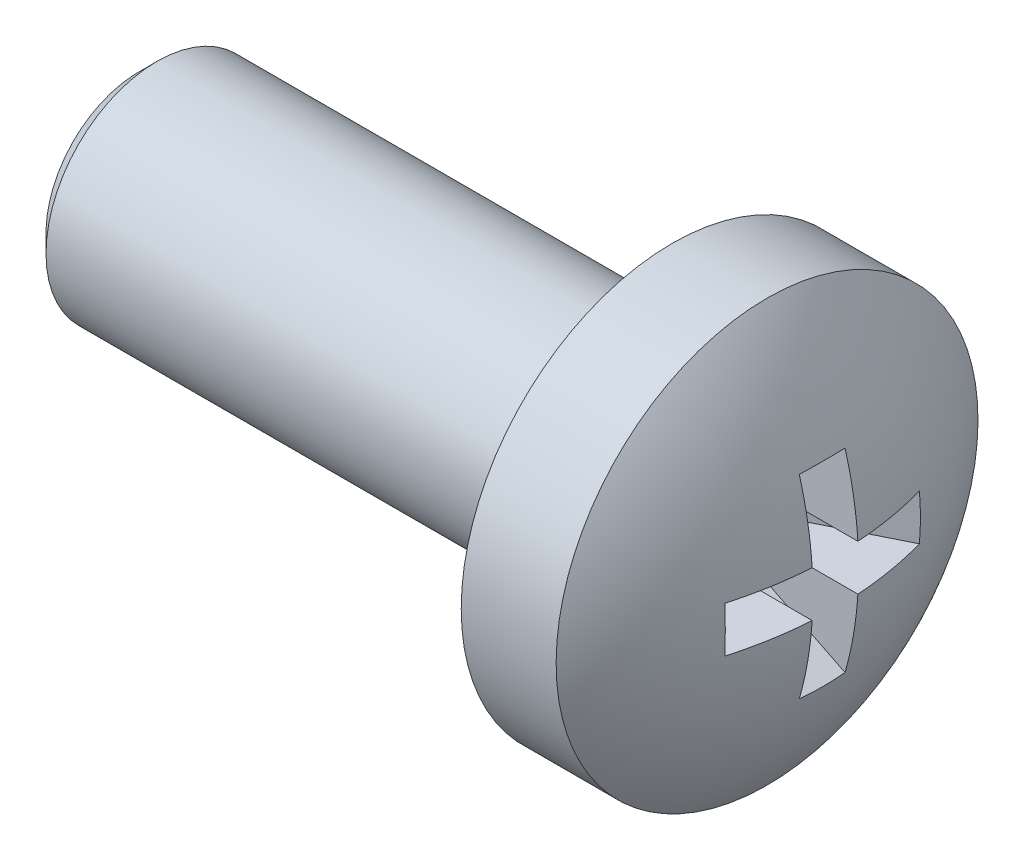
ISO-10303-21;
HEADER;
FILE_DESCRIPTION(('STEP AP214'),'2;1');
FILE_NAME('part.step','',(''),(''),'','','');
FILE_SCHEMA(('AUTOMOTIVE_DESIGN { 1 0 10303 214 1 1 1 1 }'));
ENDSEC;
DATA;
#1=APPLICATION_CONTEXT('core data for automotive mechanical design processes');
#2=APPLICATION_PROTOCOL_DEFINITION('international standard','automotive_design',2000,#1);
#3=PRODUCT_CONTEXT('',#1,'mechanical');
#4=PRODUCT('Part','Part','',(#3));
#5=PRODUCT_RELATED_PRODUCT_CATEGORY('part','',(#4));
#6=PRODUCT_DEFINITION_FORMATION('','',#4);
#7=PRODUCT_DEFINITION_CONTEXT('part definition',#1,'design');
#8=PRODUCT_DEFINITION('design','',#6,#7);
#9=PRODUCT_DEFINITION_SHAPE('','',#8);
#10=(LENGTH_UNIT() NAMED_UNIT(*) SI_UNIT(.MILLI.,.METRE.));
#11=(NAMED_UNIT(*) PLANE_ANGLE_UNIT() SI_UNIT($,.RADIAN.));
#12=(NAMED_UNIT(*) SI_UNIT($,.STERADIAN.) SOLID_ANGLE_UNIT());
#13=UNCERTAINTY_MEASURE_WITH_UNIT(LENGTH_MEASURE(1.E-05),#10,'distance_accuracy_value','');
#14=(GEOMETRIC_REPRESENTATION_CONTEXT(3) GLOBAL_UNCERTAINTY_ASSIGNED_CONTEXT((#13)) GLOBAL_UNIT_ASSIGNED_CONTEXT((#10,
#11,#12)) REPRESENTATION_CONTEXT('',''));
#15=CARTESIAN_POINT('',(0.,0.,0.));
#16=DIRECTION('',(0.,0.,1.));
#17=DIRECTION('',(1.,0.,0.));
#18=AXIS2_PLACEMENT_3D('',#15,#16,#17);
#19=CARTESIAN_POINT('',(-8.,0.,0.));
#20=DIRECTION('',(1.,0.,0.));
#21=DIRECTION('',(0.,-1.,0.));
#22=AXIS2_PLACEMENT_3D('',#19,#20,#21);
#23=SPHERICAL_SURFACE('',#22,8.);
#24=CARTESIAN_POINT('',(-7.34565681691376,0.,-1.31240938798552));
#25=DIRECTION('',(0.446197813109809,0.,-0.894934361602025));
#26=DIRECTION('',(-0.894934361602025,0.,-0.446197813109809));
#27=AXIS2_PLACEMENT_3D('',#24,#25,#26);
#28=CIRCLE('',#27,7.86444000530718);
#29=CARTESIAN_POINT('',(-0.322606080628619,0.515,2.18915454155237));
#30=VERTEX_POINT('',#29);
#31=CARTESIAN_POINT('',(-0.322606080628619,-0.515,2.18915454155237));
#32=VERTEX_POINT('',#31);
#33=EDGE_CURVE('E195',#30,#32,#28,.T.);
#34=ORIENTED_EDGE('',*,*,#33,.F.);
#35=CARTESIAN_POINT('',(-8.,0.515,0.));
#36=DIRECTION('',(0.,-1.,0.));
#37=DIRECTION('',(0.,0.,-1.));
#38=AXIS2_PLACEMENT_3D('',#35,#36,#37);
#39=CIRCLE('',#38,7.98340622792051);
#40=CARTESIAN_POINT('',(-0.0332221067736553,0.515,0.515));
#41=VERTEX_POINT('',#40);
#42=EDGE_CURVE('E114',#30,#41,#39,.F.);
#43=ORIENTED_EDGE('',*,*,#42,.T.);
#44=CARTESIAN_POINT('',(-8.,0.,0.515));
#45=DIRECTION('',(0.,0.,1.));
#46=DIRECTION('',(0.,-1.,0.));
#47=AXIS2_PLACEMENT_3D('',#44,#45,#46);
#48=CIRCLE('',#47,7.98340622792051);
#49=CARTESIAN_POINT('',(-0.32260608062862,2.18915454155236,0.515));
#50=VERTEX_POINT('',#49);
#51=EDGE_CURVE('E146',#50,#41,#48,.F.);
#52=ORIENTED_EDGE('',*,*,#51,.F.);
#53=CARTESIAN_POINT('',(-7.34565681691376,-1.31240938798552,0.));
#54=DIRECTION('',(0.446197813109809,-0.894934361602025,0.));
#55=DIRECTION('',(0.894934361602025,0.446197813109809,0.));
#56=AXIS2_PLACEMENT_3D('',#53,#54,#55);
#57=CIRCLE('',#56,7.86444000530718);
#58=CARTESIAN_POINT('',(-0.32260608062862,2.18915454155236,-0.515));
#59=VERTEX_POINT('',#58);
#60=EDGE_CURVE('E143',#50,#59,#57,.F.);
#61=ORIENTED_EDGE('',*,*,#60,.T.);
#62=CARTESIAN_POINT('',(-8.,0.,-0.515));
#63=DIRECTION('',(0.,0.,1.));
#64=DIRECTION('',(0.,-1.,0.));
#65=AXIS2_PLACEMENT_3D('',#62,#63,#64);
#66=CIRCLE('',#65,7.98340622792051);
#67=CARTESIAN_POINT('',(-0.0332221067736553,0.515,-0.515));
#68=VERTEX_POINT('',#67);
#69=EDGE_CURVE('E147',#59,#68,#66,.F.);
#70=ORIENTED_EDGE('',*,*,#69,.T.);
#71=CARTESIAN_POINT('',(-8.,0.515,0.));
#72=DIRECTION('',(0.,-1.,0.));
#73=DIRECTION('',(0.,0.,-1.));
#74=AXIS2_PLACEMENT_3D('',#71,#72,#73);
#75=CIRCLE('',#74,7.98340622792051);
#76=CARTESIAN_POINT('',(-0.322606080628619,0.515,-2.18915454155237));
#77=VERTEX_POINT('',#76);
#78=EDGE_CURVE('E197',#68,#77,#75,.F.);
#79=ORIENTED_EDGE('',*,*,#78,.T.);
#80=CARTESIAN_POINT('',(-7.34565681691376,0.,1.31240938798552));
#81=DIRECTION('',(0.446197813109809,0.,0.894934361602025));
#82=DIRECTION('',(0.894934361602025,0.,-0.446197813109809));
#83=AXIS2_PLACEMENT_3D('',#80,#81,#82);
#84=CIRCLE('',#83,7.86444000530718);
#85=CARTESIAN_POINT('',(-0.322606080628619,-0.515,-2.18915454155237));
#86=VERTEX_POINT('',#85);
#87=EDGE_CURVE('E200',#77,#86,#84,.F.);
#88=ORIENTED_EDGE('',*,*,#87,.T.);
#89=CARTESIAN_POINT('',(-8.,-0.515,0.));
#90=DIRECTION('',(0.,-1.,0.));
#91=DIRECTION('',(0.,0.,-1.));
#92=AXIS2_PLACEMENT_3D('',#89,#90,#91);
#93=CIRCLE('',#92,7.98340622792051);
#94=CARTESIAN_POINT('',(-0.0332221067736553,-0.515,-0.515));
#95=VERTEX_POINT('',#94);
#96=EDGE_CURVE('E201',#95,#86,#93,.F.);
#97=ORIENTED_EDGE('',*,*,#96,.F.);
#98=CARTESIAN_POINT('',(-8.,0.,-0.515));
#99=DIRECTION('',(0.,0.,1.));
#100=DIRECTION('',(0.,-1.,0.));
#101=AXIS2_PLACEMENT_3D('',#98,#99,#100);
#102=CIRCLE('',#101,7.98340622792051);
#103=CARTESIAN_POINT('',(-0.322606080628619,-2.18915454155237,-0.515));
#104=VERTEX_POINT('',#103);
#105=EDGE_CURVE('E157',#95,#104,#102,.F.);
#106=ORIENTED_EDGE('',*,*,#105,.T.);
#107=CARTESIAN_POINT('',(-7.34565681691376,1.31240938798552,0.));
#108=DIRECTION('',(0.446197813109809,0.894934361602025,0.));
#109=DIRECTION('',(-0.894934361602025,0.446197813109809,0.));
#110=AXIS2_PLACEMENT_3D('',#107,#108,#109);
#111=CIRCLE('',#110,7.86444000530718);
#112=CARTESIAN_POINT('',(-0.322606080628619,-2.18915454155237,0.515));
#113=VERTEX_POINT('',#112);
#114=EDGE_CURVE('E154',#113,#104,#111,.T.);
#115=ORIENTED_EDGE('',*,*,#114,.F.);
#116=CARTESIAN_POINT('',(-8.,0.,0.515));
#117=DIRECTION('',(0.,0.,1.));
#118=DIRECTION('',(0.,-1.,0.));
#119=AXIS2_PLACEMENT_3D('',#116,#117,#118);
#120=CIRCLE('',#119,7.98340622792051);
#121=CARTESIAN_POINT('',(-0.0332221067736553,-0.515,0.515));
#122=VERTEX_POINT('',#121);
#123=EDGE_CURVE('E158',#122,#113,#120,.F.);
#124=ORIENTED_EDGE('',*,*,#123,.F.);
#125=CARTESIAN_POINT('',(-8.,-0.515,0.));
#126=DIRECTION('',(0.,-1.,0.));
#127=DIRECTION('',(0.,0.,-1.));
#128=AXIS2_PLACEMENT_3D('',#125,#126,#127);
#129=CIRCLE('',#128,7.98340622792051);
#130=EDGE_CURVE('E193',#32,#122,#129,.F.);
#131=ORIENTED_EDGE('',*,*,#130,.F.);
#132=EDGE_LOOP('',(#34,#43,#52,#61,#70,#79,#88,#97,#106,#115,#124,#131));
#133=FACE_BOUND('',#132,.T.);
#134=CARTESIAN_POINT('',(-1.56280340520813,0.,0.));
#135=DIRECTION('',(1.,0.,0.));
#136=DIRECTION('',(0.,1.,0.));
#137=AXIS2_PLACEMENT_3D('',#134,#135,#136);
#138=CIRCLE('',#137,4.75);
#139=CARTESIAN_POINT('',(-1.56280340520814,4.75,0.));
#140=VERTEX_POINT('',#139);
#141=EDGE_CURVE('E118',#140,#140,#138,.T.);
#142=ORIENTED_EDGE('',*,*,#141,.T.);
#143=EDGE_LOOP('',(#142));
#144=FACE_BOUND('',#143,.T.);
#145=ADVANCED_FACE('F16',(#133,#144),#23,.T.);
#146=CARTESIAN_POINT('',(-15.7,0.,0.));
#147=DIRECTION('',(-1.,0.,0.));
#148=DIRECTION('',(0.,-1.,0.));
#149=AXIS2_PLACEMENT_3D('',#146,#147,#148);
#150=PLANE('',#149);
#151=CARTESIAN_POINT('',(-15.7,0.,0.));
#152=DIRECTION('',(-1.,0.,0.));
#153=DIRECTION('',(0.,-1.,0.));
#154=AXIS2_PLACEMENT_3D('',#151,#152,#153);
#155=CIRCLE('',#154,2.1);
#156=CARTESIAN_POINT('',(-15.7,-2.1,0.));
#157=VERTEX_POINT('',#156);
#158=EDGE_CURVE('E10',#157,#157,#155,.T.);
#159=ORIENTED_EDGE('',*,*,#158,.T.);
#160=EDGE_LOOP('',(#159));
#161=FACE_BOUND('',#160,.T.);
#162=ADVANCED_FACE('F262',(#161),#150,.T.);
#163=CARTESIAN_POINT('',(0.,0.,0.));
#164=DIRECTION('',(1.,0.,0.));
#165=DIRECTION('',(0.,1.,0.));
#166=AXIS2_PLACEMENT_3D('',#163,#164,#165);
#167=CYLINDRICAL_SURFACE('',#166,2.5);
#168=CARTESIAN_POINT('',(-15.3,0.,0.));
#169=DIRECTION('',(-1.,0.,0.));
#170=DIRECTION('',(0.,-1.,0.));
#171=AXIS2_PLACEMENT_3D('',#168,#169,#170);
#172=CIRCLE('',#171,2.5);
#173=CARTESIAN_POINT('',(-15.3,-2.5,0.));
#174=VERTEX_POINT('',#173);
#175=EDGE_CURVE('E26',#174,#174,#172,.F.);
#176=ORIENTED_EDGE('',*,*,#175,.T.);
#177=EDGE_LOOP('',(#176));
#178=FACE_BOUND('',#177,.T.);
#179=CARTESIAN_POINT('',(-3.7,0.,0.));
#180=DIRECTION('',(1.,0.,0.));
#181=DIRECTION('',(0.,1.,0.));
#182=AXIS2_PLACEMENT_3D('',#179,#180,#181);
#183=CIRCLE('',#182,2.5);
#184=CARTESIAN_POINT('',(-3.7,2.5,0.));
#185=VERTEX_POINT('',#184);
#186=EDGE_CURVE('E190',#185,#185,#183,.T.);
#187=ORIENTED_EDGE('',*,*,#186,.F.);
#188=EDGE_LOOP('',(#187));
#189=FACE_BOUND('',#188,.T.);
#190=ADVANCED_FACE('F268',(#178,#189),#167,.T.);
#191=CARTESIAN_POINT('',(-3.7,2.5,0.));
#192=DIRECTION('',(-1.,0.,0.));
#193=DIRECTION('',(0.,-1.,0.));
#194=AXIS2_PLACEMENT_3D('',#191,#192,#193);
#195=PLANE('',#194);
#196=ORIENTED_EDGE('',*,*,#186,.T.);
#197=EDGE_LOOP('',(#196));
#198=FACE_BOUND('',#197,.T.);
#199=CARTESIAN_POINT('',(-3.7,0.,0.));
#200=DIRECTION('',(1.,0.,0.));
#201=DIRECTION('',(0.,1.,0.));
#202=AXIS2_PLACEMENT_3D('',#199,#200,#201);
#203=CIRCLE('',#202,4.75);
#204=CARTESIAN_POINT('',(-3.7,4.75,0.));
#205=VERTEX_POINT('',#204);
#206=EDGE_CURVE('E187',#205,#205,#203,.T.);
#207=ORIENTED_EDGE('',*,*,#206,.F.);
#208=EDGE_LOOP('',(#207));
#209=FACE_BOUND('',#208,.T.);
#210=ADVANCED_FACE('F299',(#198,#209),#195,.T.);
#211=CARTESIAN_POINT('',(0.,0.,0.));
#212=DIRECTION('',(1.,0.,0.));
#213=DIRECTION('',(0.,1.,0.));
#214=AXIS2_PLACEMENT_3D('',#211,#212,#213);
#215=CYLINDRICAL_SURFACE('',#214,4.75);
#216=ORIENTED_EDGE('',*,*,#206,.T.);
#217=EDGE_LOOP('',(#216));
#218=FACE_BOUND('',#217,.T.);
#219=ORIENTED_EDGE('',*,*,#141,.F.);
#220=EDGE_LOOP('',(#219));
#221=FACE_BOUND('',#220,.T.);
#222=ADVANCED_FACE('F296',(#218,#221),#215,.T.);
#223=CARTESIAN_POINT('',(0.,0.,2.35));
#224=DIRECTION('',(0.446197813109809,0.,-0.894934361602025));
#225=DIRECTION('',(-0.894934361602025,0.,-0.446197813109809));
#226=AXIS2_PLACEMENT_3D('',#223,#224,#225);
#227=PLANE('',#226);
#228=ORIENTED_EDGE('',*,*,#33,.T.);
#229=DIRECTION('',(-0.894934361602025,0.,-0.446197813109809));
#230=VECTOR('',#229,1.);
#231=CARTESIAN_POINT('',(0.,-0.515,2.35));
#232=LINE('',#231,#230);
#233=CARTESIAN_POINT('',(-2.74,-0.515,0.983886393933594));
#234=VERTEX_POINT('',#233);
#235=EDGE_CURVE('E35',#234,#32,#232,.F.);
#236=ORIENTED_EDGE('',*,*,#235,.F.);
#237=DIRECTION('',(0.,1.,0.));
#238=VECTOR('',#237,1.);
#239=CARTESIAN_POINT('',(-2.74,0.,0.983886393933595));
#240=LINE('',#239,#238);
#241=CARTESIAN_POINT('',(-2.74,0.515,0.983886393933595));
#242=VERTEX_POINT('',#241);
#243=EDGE_CURVE('E126',#242,#234,#240,.F.);
#244=ORIENTED_EDGE('',*,*,#243,.F.);
#245=DIRECTION('',(-0.894934361602025,0.,-0.446197813109809));
#246=VECTOR('',#245,1.);
#247=CARTESIAN_POINT('',(0.,0.515,2.35));
#248=LINE('',#247,#246);
#249=EDGE_CURVE('E107',#242,#30,#248,.F.);
#250=ORIENTED_EDGE('',*,*,#249,.T.);
#251=EDGE_LOOP('',(#228,#236,#244,#250));
#252=FACE_BOUND('',#251,.T.);
#253=ADVANCED_FACE('F18',(#252),#227,.T.);
#254=CARTESIAN_POINT('',(-2.74,0.515,0.));
#255=DIRECTION('',(0.,-1.,0.));
#256=DIRECTION('',(0.,0.,-1.));
#257=AXIS2_PLACEMENT_3D('',#254,#255,#256);
#258=PLANE('',#257);
#259=ORIENTED_EDGE('',*,*,#249,.F.);
#260=DIRECTION('',(0.,0.,-1.));
#261=VECTOR('',#260,1.);
#262=CARTESIAN_POINT('',(-2.74,0.515,0.));
#263=LINE('',#262,#261);
#264=CARTESIAN_POINT('',(-2.74,0.515,0.515));
#265=VERTEX_POINT('',#264);
#266=EDGE_CURVE('E111',#242,#265,#263,.T.);
#267=ORIENTED_EDGE('',*,*,#266,.T.);
#268=DIRECTION('',(1.,0.,0.));
#269=VECTOR('',#268,1.);
#270=CARTESIAN_POINT('',(-2.74,0.515,0.515));
#271=LINE('',#270,#269);
#272=EDGE_CURVE('E119',#265,#41,#271,.T.);
#273=ORIENTED_EDGE('',*,*,#272,.T.);
#274=ORIENTED_EDGE('',*,*,#42,.F.);
#275=EDGE_LOOP('',(#259,#267,#273,#274));
#276=FACE_BOUND('',#275,.T.);
#277=ADVANCED_FACE('F109',(#276),#258,.T.);
#278=CARTESIAN_POINT('',(-2.74,0.,0.515));
#279=DIRECTION('',(0.,0.,1.));
#280=DIRECTION('',(0.,-1.,0.));
#281=AXIS2_PLACEMENT_3D('',#278,#279,#280);
#282=PLANE('',#281);
#283=ORIENTED_EDGE('',*,*,#51,.T.);
#284=ORIENTED_EDGE('',*,*,#272,.F.);
#285=DIRECTION('',(0.,-1.,0.));
#286=VECTOR('',#285,1.);
#287=CARTESIAN_POINT('',(-2.74,0.,0.515));
#288=LINE('',#287,#286);
#289=CARTESIAN_POINT('',(-2.74,0.983886393933595,0.515));
#290=VERTEX_POINT('',#289);
#291=EDGE_CURVE('E129',#290,#265,#288,.T.);
#292=ORIENTED_EDGE('',*,*,#291,.F.);
#293=DIRECTION('',(0.894934361602025,0.446197813109809,0.));
#294=VECTOR('',#293,1.);
#295=CARTESIAN_POINT('',(-3.13288330602388,0.788002003438862,0.515));
#296=LINE('',#295,#294);
#297=EDGE_CURVE('E139',#290,#50,#296,.T.);
#298=ORIENTED_EDGE('',*,*,#297,.T.);
#299=EDGE_LOOP('',(#283,#284,#292,#298));
#300=FACE_BOUND('',#299,.T.);
#301=ADVANCED_FACE('F250',(#300),#282,.F.);
#302=CARTESIAN_POINT('',(0.,2.35,0.));
#303=DIRECTION('',(0.446197813109809,-0.894934361602025,0.));
#304=DIRECTION('',(0.894934361602025,0.446197813109809,0.));
#305=AXIS2_PLACEMENT_3D('',#302,#303,#304);
#306=PLANE('',#305);
#307=ORIENTED_EDGE('',*,*,#297,.F.);
#308=DIRECTION('',(0.,0.,-1.));
#309=VECTOR('',#308,1.);
#310=CARTESIAN_POINT('',(-2.74,0.983886393933595,0.));
#311=LINE('',#310,#309);
#312=CARTESIAN_POINT('',(-2.74,0.983886393933595,-0.515));
#313=VERTEX_POINT('',#312);
#314=EDGE_CURVE('E151',#290,#313,#311,.T.);
#315=ORIENTED_EDGE('',*,*,#314,.T.);
#316=DIRECTION('',(0.894934361602025,0.446197813109809,0.));
#317=VECTOR('',#316,1.);
#318=CARTESIAN_POINT('',(-3.13288330602388,0.788002003438862,-0.515));
#319=LINE('',#318,#317);
#320=EDGE_CURVE('E142',#313,#59,#319,.T.);
#321=ORIENTED_EDGE('',*,*,#320,.T.);
#322=ORIENTED_EDGE('',*,*,#60,.F.);
#323=EDGE_LOOP('',(#307,#315,#321,#322));
#324=FACE_BOUND('',#323,.T.);
#325=ADVANCED_FACE('F248',(#324),#306,.T.);
#326=CARTESIAN_POINT('',(-2.74,0.,-0.515));
#327=DIRECTION('',(0.,0.,1.));
#328=DIRECTION('',(0.,-1.,0.));
#329=AXIS2_PLACEMENT_3D('',#326,#327,#328);
#330=PLANE('',#329);
#331=ORIENTED_EDGE('',*,*,#320,.F.);
#332=DIRECTION('',(0.,-1.,0.));
#333=VECTOR('',#332,1.);
#334=CARTESIAN_POINT('',(-2.74,0.,-0.515));
#335=LINE('',#334,#333);
#336=CARTESIAN_POINT('',(-2.74,0.515,-0.515));
#337=VERTEX_POINT('',#336);
#338=EDGE_CURVE('E153',#313,#337,#335,.T.);
#339=ORIENTED_EDGE('',*,*,#338,.T.);
#340=DIRECTION('',(1.,0.,0.));
#341=VECTOR('',#340,1.);
#342=CARTESIAN_POINT('',(-2.74,0.515,-0.515));
#343=LINE('',#342,#341);
#344=EDGE_CURVE('E150',#337,#68,#343,.T.);
#345=ORIENTED_EDGE('',*,*,#344,.T.);
#346=ORIENTED_EDGE('',*,*,#69,.F.);
#347=EDGE_LOOP('',(#331,#339,#345,#346));
#348=FACE_BOUND('',#347,.T.);
#349=ADVANCED_FACE('F245',(#348),#330,.T.);
#350=CARTESIAN_POINT('',(-2.74,0.515,0.));
#351=DIRECTION('',(0.,-1.,0.));
#352=DIRECTION('',(0.,0.,-1.));
#353=AXIS2_PLACEMENT_3D('',#350,#351,#352);
#354=PLANE('',#353);
#355=ORIENTED_EDGE('',*,*,#344,.F.);
#356=DIRECTION('',(0.,0.,-1.));
#357=VECTOR('',#356,1.);
#358=CARTESIAN_POINT('',(-2.74,0.515,0.));
#359=LINE('',#358,#357);
#360=CARTESIAN_POINT('',(-2.74,0.515,-0.983886393933595));
#361=VERTEX_POINT('',#360);
#362=EDGE_CURVE('E173',#337,#361,#359,.T.);
#363=ORIENTED_EDGE('',*,*,#362,.T.);
#364=DIRECTION('',(0.894934361602025,0.,-0.446197813109809));
#365=VECTOR('',#364,1.);
#366=CARTESIAN_POINT('',(0.,0.515,-2.35));
#367=LINE('',#366,#365);
#368=EDGE_CURVE('E180',#361,#77,#367,.T.);
#369=ORIENTED_EDGE('',*,*,#368,.T.);
#370=ORIENTED_EDGE('',*,*,#78,.F.);
#371=EDGE_LOOP('',(#355,#363,#369,#370));
#372=FACE_BOUND('',#371,.T.);
#373=ADVANCED_FACE('F242',(#372),#354,.T.);
#374=CARTESIAN_POINT('',(0.,0.,-2.35));
#375=DIRECTION('',(0.446197813109809,0.,0.894934361602025));
#376=DIRECTION('',(0.894934361602025,0.,-0.446197813109809));
#377=AXIS2_PLACEMENT_3D('',#374,#375,#376);
#378=PLANE('',#377);
#379=ORIENTED_EDGE('',*,*,#368,.F.);
#380=DIRECTION('',(0.,-1.,0.));
#381=VECTOR('',#380,1.);
#382=CARTESIAN_POINT('',(-2.74,0.,-0.983886393933595));
#383=LINE('',#382,#381);
#384=CARTESIAN_POINT('',(-2.74,-0.515,-0.983886393933594));
#385=VERTEX_POINT('',#384);
#386=EDGE_CURVE('E172',#361,#385,#383,.T.);
#387=ORIENTED_EDGE('',*,*,#386,.T.);
#388=DIRECTION('',(0.894934361602025,0.,-0.446197813109809));
#389=VECTOR('',#388,1.);
#390=CARTESIAN_POINT('',(0.,-0.515,-2.35));
#391=LINE('',#390,#389);
#392=EDGE_CURVE('E182',#385,#86,#391,.T.);
#393=ORIENTED_EDGE('',*,*,#392,.T.);
#394=ORIENTED_EDGE('',*,*,#87,.F.);
#395=EDGE_LOOP('',(#379,#387,#393,#394));
#396=FACE_BOUND('',#395,.T.);
#397=ADVANCED_FACE('F236',(#396),#378,.T.);
#398=CARTESIAN_POINT('',(-2.74,-0.515,0.));
#399=DIRECTION('',(0.,-1.,0.));
#400=DIRECTION('',(0.,0.,-1.));
#401=AXIS2_PLACEMENT_3D('',#398,#399,#400);
#402=PLANE('',#401);
#403=ORIENTED_EDGE('',*,*,#96,.T.);
#404=ORIENTED_EDGE('',*,*,#392,.F.);
#405=DIRECTION('',(0.,0.,-1.));
#406=VECTOR('',#405,1.);
#407=CARTESIAN_POINT('',(-2.74,-0.515,0.));
#408=LINE('',#407,#406);
#409=CARTESIAN_POINT('',(-2.74,-0.515,-0.515));
#410=VERTEX_POINT('',#409);
#411=EDGE_CURVE('E165',#410,#385,#408,.T.);
#412=ORIENTED_EDGE('',*,*,#411,.F.);
#413=DIRECTION('',(1.,0.,0.));
#414=VECTOR('',#413,1.);
#415=CARTESIAN_POINT('',(-2.74,-0.515,-0.515));
#416=LINE('',#415,#414);
#417=EDGE_CURVE('E79',#410,#95,#416,.T.);
#418=ORIENTED_EDGE('',*,*,#417,.T.);
#419=EDGE_LOOP('',(#403,#404,#412,#418));
#420=FACE_BOUND('',#419,.T.);
#421=ADVANCED_FACE('F232',(#420),#402,.F.);
#422=CARTESIAN_POINT('',(-2.74,0.,-0.515));
#423=DIRECTION('',(0.,0.,1.));
#424=DIRECTION('',(0.,-1.,0.));
#425=AXIS2_PLACEMENT_3D('',#422,#423,#424);
#426=PLANE('',#425);
#427=ORIENTED_EDGE('',*,*,#417,.F.);
#428=DIRECTION('',(0.,-1.,0.));
#429=VECTOR('',#428,1.);
#430=CARTESIAN_POINT('',(-2.74,0.,-0.515));
#431=LINE('',#430,#429);
#432=CARTESIAN_POINT('',(-2.74,-0.983886393933595,-0.515));
#433=VERTEX_POINT('',#432);
#434=EDGE_CURVE('E73',#410,#433,#431,.T.);
#435=ORIENTED_EDGE('',*,*,#434,.T.);
#436=DIRECTION('',(-0.894934361602025,0.446197813109809,0.));
#437=VECTOR('',#436,1.);
#438=CARTESIAN_POINT('',(-3.13288330602388,-0.788002003438862,-0.515));
#439=LINE('',#438,#437);
#440=EDGE_CURVE('E20',#433,#104,#439,.F.);
#441=ORIENTED_EDGE('',*,*,#440,.T.);
#442=ORIENTED_EDGE('',*,*,#105,.F.);
#443=EDGE_LOOP('',(#427,#435,#441,#442));
#444=FACE_BOUND('',#443,.T.);
#445=ADVANCED_FACE('F228',(#444),#426,.T.);
#446=CARTESIAN_POINT('',(0.,-2.35,0.));
#447=DIRECTION('',(0.446197813109809,0.894934361602025,0.));
#448=DIRECTION('',(-0.894934361602025,0.446197813109809,0.));
#449=AXIS2_PLACEMENT_3D('',#446,#447,#448);
#450=PLANE('',#449);
#451=ORIENTED_EDGE('',*,*,#114,.T.);
#452=ORIENTED_EDGE('',*,*,#440,.F.);
#453=DIRECTION('',(0.,0.,1.));
#454=VECTOR('',#453,1.);
#455=CARTESIAN_POINT('',(-2.74,-0.983886393933595,0.));
#456=LINE('',#455,#454);
#457=CARTESIAN_POINT('',(-2.74,-0.983886393933595,0.515));
#458=VERTEX_POINT('',#457);
#459=EDGE_CURVE('E161',#458,#433,#456,.F.);
#460=ORIENTED_EDGE('',*,*,#459,.F.);
#461=DIRECTION('',(-0.894934361602025,0.446197813109809,0.));
#462=VECTOR('',#461,1.);
#463=CARTESIAN_POINT('',(-3.13288330602388,-0.788002003438862,0.515));
#464=LINE('',#463,#462);
#465=EDGE_CURVE('E159',#458,#113,#464,.F.);
#466=ORIENTED_EDGE('',*,*,#465,.T.);
#467=EDGE_LOOP('',(#451,#452,#460,#466));
#468=FACE_BOUND('',#467,.T.);
#469=ADVANCED_FACE('F227',(#468),#450,.T.);
#470=CARTESIAN_POINT('',(-2.74,0.,0.515));
#471=DIRECTION('',(0.,0.,1.));
#472=DIRECTION('',(0.,-1.,0.));
#473=AXIS2_PLACEMENT_3D('',#470,#471,#472);
#474=PLANE('',#473);
#475=ORIENTED_EDGE('',*,*,#123,.T.);
#476=ORIENTED_EDGE('',*,*,#465,.F.);
#477=DIRECTION('',(0.,-1.,0.));
#478=VECTOR('',#477,1.);
#479=CARTESIAN_POINT('',(-2.74,0.,0.515));
#480=LINE('',#479,#478);
#481=CARTESIAN_POINT('',(-2.74,-0.515,0.515));
#482=VERTEX_POINT('',#481);
#483=EDGE_CURVE('E133',#482,#458,#480,.T.);
#484=ORIENTED_EDGE('',*,*,#483,.F.);
#485=DIRECTION('',(1.,0.,0.));
#486=VECTOR('',#485,1.);
#487=CARTESIAN_POINT('',(-2.74,-0.515,0.515));
#488=LINE('',#487,#486);
#489=EDGE_CURVE('E138',#482,#122,#488,.T.);
#490=ORIENTED_EDGE('',*,*,#489,.T.);
#491=EDGE_LOOP('',(#475,#476,#484,#490));
#492=FACE_BOUND('',#491,.T.);
#493=ADVANCED_FACE('F225',(#492),#474,.F.);
#494=CARTESIAN_POINT('',(-2.74,-0.515,0.));
#495=DIRECTION('',(0.,-1.,0.));
#496=DIRECTION('',(0.,0.,-1.));
#497=AXIS2_PLACEMENT_3D('',#494,#495,#496);
#498=PLANE('',#497);
#499=ORIENTED_EDGE('',*,*,#130,.T.);
#500=ORIENTED_EDGE('',*,*,#489,.F.);
#501=DIRECTION('',(0.,0.,-1.));
#502=VECTOR('',#501,1.);
#503=CARTESIAN_POINT('',(-2.74,-0.515,0.));
#504=LINE('',#503,#502);
#505=EDGE_CURVE('E131',#234,#482,#504,.T.);
#506=ORIENTED_EDGE('',*,*,#505,.F.);
#507=ORIENTED_EDGE('',*,*,#235,.T.);
#508=EDGE_LOOP('',(#499,#500,#506,#507));
#509=FACE_BOUND('',#508,.T.);
#510=ADVANCED_FACE('F223',(#509),#498,.F.);
#511=CARTESIAN_POINT('',(-2.74,0.,0.));
#512=DIRECTION('',(1.,0.,0.));
#513=DIRECTION('',(0.,0.,-1.));
#514=AXIS2_PLACEMENT_3D('',#511,#512,#513);
#515=PLANE('',#514);
#516=ORIENTED_EDGE('',*,*,#243,.T.);
#517=ORIENTED_EDGE('',*,*,#505,.T.);
#518=ORIENTED_EDGE('',*,*,#483,.T.);
#519=ORIENTED_EDGE('',*,*,#459,.T.);
#520=ORIENTED_EDGE('',*,*,#434,.F.);
#521=ORIENTED_EDGE('',*,*,#411,.T.);
#522=ORIENTED_EDGE('',*,*,#386,.F.);
#523=ORIENTED_EDGE('',*,*,#362,.F.);
#524=ORIENTED_EDGE('',*,*,#338,.F.);
#525=ORIENTED_EDGE('',*,*,#314,.F.);
#526=ORIENTED_EDGE('',*,*,#291,.T.);
#527=ORIENTED_EDGE('',*,*,#266,.F.);
#528=EDGE_LOOP('',(#516,#517,#518,#519,#520,#521,#522,#523,#524,#525,#526,#527));
#529=FACE_BOUND('',#528,.T.);
#530=ADVANCED_FACE('F124',(#529),#515,.T.);
#531=CARTESIAN_POINT('',(-15.3,0.,0.));
#532=DIRECTION('',(1.,0.,0.));
#533=DIRECTION('',(0.,1.,0.));
#534=AXIS2_PLACEMENT_3D('',#531,#532,#533);
#535=CONICAL_SURFACE('',#534,2.5,0.785398163397448);
#536=ORIENTED_EDGE('',*,*,#158,.F.);
#537=EDGE_LOOP('',(#536));
#538=FACE_BOUND('',#537,.T.);
#539=ORIENTED_EDGE('',*,*,#175,.F.);
#540=EDGE_LOOP('',(#539));
#541=FACE_BOUND('',#540,.T.);
#542=ADVANCED_FACE('F273',(#538,#541),#535,.T.);
#543=CLOSED_SHELL('',(#145,#162,#190,#210,#222,#253,#277,#301,#325,#349,#373,#397,#421,#445,
#469,#493,#510,#530,#542));
#544=MANIFOLD_SOLID_BREP('B1',#543);
#545=ADVANCED_BREP_SHAPE_REPRESENTATION('',(#18,#544),#14);
#546=SHAPE_DEFINITION_REPRESENTATION(#9,#545);
ENDSEC;
END-ISO-10303-21;
